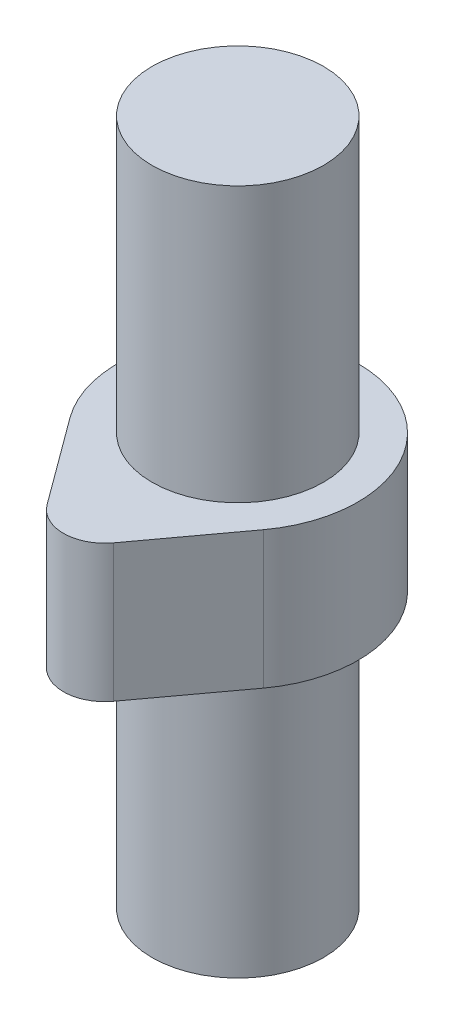
ISO-10303-21;
HEADER;
FILE_DESCRIPTION(('STEP AP214'),'2;1');
FILE_NAME('part.step','',(''),(''),'','','');
FILE_SCHEMA(('AUTOMOTIVE_DESIGN { 1 0 10303 214 1 1 1 1 }'));
ENDSEC;
DATA;
#1=APPLICATION_CONTEXT('core data for automotive mechanical design processes');
#2=APPLICATION_PROTOCOL_DEFINITION('international standard','automotive_design',2000,#1);
#3=PRODUCT_CONTEXT('',#1,'mechanical');
#4=PRODUCT('Part','Part','',(#3));
#5=PRODUCT_RELATED_PRODUCT_CATEGORY('part','',(#4));
#6=PRODUCT_DEFINITION_FORMATION('','',#4);
#7=PRODUCT_DEFINITION_CONTEXT('part definition',#1,'design');
#8=PRODUCT_DEFINITION('design','',#6,#7);
#9=PRODUCT_DEFINITION_SHAPE('','',#8);
#10=(LENGTH_UNIT() NAMED_UNIT(*) SI_UNIT(.MILLI.,.METRE.));
#11=(NAMED_UNIT(*) PLANE_ANGLE_UNIT() SI_UNIT($,.RADIAN.));
#12=(NAMED_UNIT(*) SI_UNIT($,.STERADIAN.) SOLID_ANGLE_UNIT());
#13=UNCERTAINTY_MEASURE_WITH_UNIT(LENGTH_MEASURE(1.E-05),#10,'distance_accuracy_value','');
#14=(GEOMETRIC_REPRESENTATION_CONTEXT(3) GLOBAL_UNCERTAINTY_ASSIGNED_CONTEXT((#13)) GLOBAL_UNIT_ASSIGNED_CONTEXT((#10,
#11,#12)) REPRESENTATION_CONTEXT('',''));
#15=CARTESIAN_POINT('',(0.,0.,0.));
#16=DIRECTION('',(0.,0.,1.));
#17=DIRECTION('',(1.,0.,0.));
#18=AXIS2_PLACEMENT_3D('',#15,#16,#17);
#19=CARTESIAN_POINT('',(-33.587339903571,99.6470504536906,3.70444137397527));
#20=DIRECTION('',(0.,-1.,0.));
#21=DIRECTION('',(0.,0.,-1.));
#22=AXIS2_PLACEMENT_3D('',#19,#20,#21);
#23=PLANE('',#22);
#24=CARTESIAN_POINT('',(-39.837339903571,99.6470504536906,3.70444137397565));
#25=DIRECTION('',(0.,-1.,0.));
#26=DIRECTION('',(0.,0.,-1.));
#27=AXIS2_PLACEMENT_3D('',#24,#25,#26);
#28=CIRCLE('',#27,6.25);
#29=CARTESIAN_POINT('',(-39.837339903571,99.6470504536906,-2.54555862602435));
#30=VERTEX_POINT('',#29);
#31=EDGE_CURVE('E21',#30,#30,#28,.T.);
#32=ORIENTED_EDGE('',*,*,#31,.F.);
#33=EDGE_LOOP('',(#32));
#34=FACE_BOUND('',#33,.T.);
#35=ADVANCED_FACE('F17',(#34),#23,.F.);
#36=CARTESIAN_POINT('',(-39.837339903571,99.6470504536906,3.70444137397565));
#37=DIRECTION('',(0.,-1.,0.));
#38=DIRECTION('',(0.,0.,-1.));
#39=AXIS2_PLACEMENT_3D('',#36,#37,#38);
#40=CYLINDRICAL_SURFACE('',#39,6.25);
#41=ORIENTED_EDGE('',*,*,#31,.T.);
#42=EDGE_LOOP('',(#41));
#43=FACE_BOUND('',#42,.T.);
#44=CARTESIAN_POINT('',(-39.837339903571,79.6470504536906,3.70444137397565));
#45=DIRECTION('',(0.,-1.,0.));
#46=DIRECTION('',(0.,0.,-1.));
#47=AXIS2_PLACEMENT_3D('',#44,#45,#46);
#48=CIRCLE('',#47,6.25);
#49=CARTESIAN_POINT('',(-39.837339903571,79.6470504536906,-2.54555862602435));
#50=VERTEX_POINT('',#49);
#51=EDGE_CURVE('E75',#50,#50,#48,.F.);
#52=ORIENTED_EDGE('',*,*,#51,.T.);
#53=EDGE_LOOP('',(#52));
#54=FACE_BOUND('',#53,.T.);
#55=ADVANCED_FACE('F100',(#43,#54),#40,.T.);
#56=CARTESIAN_POINT('',(-46.8842561268218,79.6470504536906,8.89129704407918));
#57=DIRECTION('',(0.,-1.,0.));
#58=DIRECTION('',(0.,0.,-1.));
#59=AXIS2_PLACEMENT_3D('',#56,#57,#58);
#60=PLANE('',#59);
#61=ORIENTED_EDGE('',*,*,#51,.F.);
#62=EDGE_LOOP('',(#61));
#63=FACE_BOUND('',#62,.T.);
#64=DIRECTION('',(0.592783505154689,0.,0.805361854085802));
#65=VECTOR('',#64,1.);
#66=CARTESIAN_POINT('',(-42.2534254658279,79.6470504536906,15.1827918894397));
#67=LINE('',#66,#65);
#68=CARTESIAN_POINT('',(-42.2534254658279,79.6470504536906,15.1827918894397));
#69=VERTEX_POINT('',#68);
#70=CARTESIAN_POINT('',(-46.8842561268218,79.6470504536906,8.89129704407918));
#71=VERTEX_POINT('',#70);
#72=EDGE_CURVE('E66',#69,#71,#67,.F.);
#73=ORIENTED_EDGE('',*,*,#72,.F.);
#74=CARTESIAN_POINT('',(-39.8373399035705,79.6470504536906,13.4044413739756));
#75=DIRECTION('',(0.,1.,0.));
#76=DIRECTION('',(0.,0.,1.));
#77=AXIS2_PLACEMENT_3D('',#74,#75,#76);
#78=CIRCLE('',#77,3.);
#79=CARTESIAN_POINT('',(-37.4212543413128,79.6470504536906,15.1827918894394));
#80=VERTEX_POINT('',#79);
#81=EDGE_CURVE('E72',#80,#69,#78,.F.);
#82=ORIENTED_EDGE('',*,*,#81,.F.);
#83=DIRECTION('',(0.592783505154591,0.,-0.805361854085874));
#84=VECTOR('',#83,1.);
#85=CARTESIAN_POINT('',(-32.7904236803196,79.6470504536906,8.89129704407832));
#86=LINE('',#85,#84);
#87=CARTESIAN_POINT('',(-32.7904236803196,79.6470504536906,8.89129704407831));
#88=VERTEX_POINT('',#87);
#89=EDGE_CURVE('E69',#88,#80,#86,.F.);
#90=ORIENTED_EDGE('',*,*,#89,.F.);
#91=CARTESIAN_POINT('',(-39.8373399035711,79.6470504536906,3.70444137397564));
#92=DIRECTION('',(0.,1.,0.));
#93=DIRECTION('',(0.,0.,1.));
#94=AXIS2_PLACEMENT_3D('',#91,#92,#93);
#95=CIRCLE('',#94,8.75);
#96=EDGE_CURVE('E57',#71,#88,#95,.F.);
#97=ORIENTED_EDGE('',*,*,#96,.F.);
#98=EDGE_LOOP('',(#73,#82,#90,#97));
#99=FACE_BOUND('',#98,.T.);
#100=ADVANCED_FACE('F70',(#63,#99),#60,.F.);
#101=CARTESIAN_POINT('',(-32.7904236803196,74.6470504536907,8.89129704407832));
#102=DIRECTION('',(0.805361854085874,0.,0.592783505154591));
#103=DIRECTION('',(0.592783505154591,0.,-0.805361854085874));
#104=AXIS2_PLACEMENT_3D('',#101,#102,#103);
#105=PLANE('',#104);
#106=DIRECTION('',(0.59278350515459,0.,-0.805361854085875));
#107=VECTOR('',#106,1.);
#108=CARTESIAN_POINT('',(-37.4212543413128,69.6470504536906,15.1827918894394));
#109=LINE('',#108,#107);
#110=CARTESIAN_POINT('',(-37.4212543413128,69.6470504536906,15.1827918894394));
#111=VERTEX_POINT('',#110);
#112=CARTESIAN_POINT('',(-32.7904236803196,69.6470504536906,8.89129704407831));
#113=VERTEX_POINT('',#112);
#114=EDGE_CURVE('E80',#111,#113,#109,.T.);
#115=ORIENTED_EDGE('',*,*,#114,.T.);
#116=DIRECTION('',(0.,1.,0.));
#117=VECTOR('',#116,1.);
#118=CARTESIAN_POINT('',(-32.7904236803197,74.6470504536907,8.89129704407831));
#119=LINE('',#118,#117);
#120=EDGE_CURVE('E63',#88,#113,#119,.F.);
#121=ORIENTED_EDGE('',*,*,#120,.F.);
#122=ORIENTED_EDGE('',*,*,#89,.T.);
#123=DIRECTION('',(0.,1.,0.));
#124=VECTOR('',#123,1.);
#125=CARTESIAN_POINT('',(-37.4212543413128,74.6470504536907,15.1827918894394));
#126=LINE('',#125,#124);
#127=EDGE_CURVE('E129',#111,#80,#126,.T.);
#128=ORIENTED_EDGE('',*,*,#127,.F.);
#129=EDGE_LOOP('',(#115,#121,#122,#128));
#130=FACE_BOUND('',#129,.T.);
#131=ADVANCED_FACE('F78',(#130),#105,.T.);
#132=CARTESIAN_POINT('',(-39.8373399035711,69.6470504536906,3.70444137397564));
#133=DIRECTION('',(0.,1.,0.));
#134=DIRECTION('',(0.,0.,1.));
#135=AXIS2_PLACEMENT_3D('',#132,#133,#134);
#136=CYLINDRICAL_SURFACE('',#135,8.75);
#137=DIRECTION('',(0.,1.,0.));
#138=VECTOR('',#137,1.);
#139=CARTESIAN_POINT('',(-46.8842561268218,74.6470504536907,8.89129704407918));
#140=LINE('',#139,#138);
#141=CARTESIAN_POINT('',(-46.8842561268218,69.6470504536906,8.89129704407918));
#142=VERTEX_POINT('',#141);
#143=EDGE_CURVE('E64',#71,#142,#140,.F.);
#144=ORIENTED_EDGE('',*,*,#143,.F.);
#145=ORIENTED_EDGE('',*,*,#96,.T.);
#146=ORIENTED_EDGE('',*,*,#120,.T.);
#147=CARTESIAN_POINT('',(-39.8373399035711,69.6470504536906,3.70444137397564));
#148=DIRECTION('',(0.,1.,0.));
#149=DIRECTION('',(0.,0.,1.));
#150=AXIS2_PLACEMENT_3D('',#147,#148,#149);
#151=CIRCLE('',#150,8.75);
#152=EDGE_CURVE('E91',#113,#142,#151,.T.);
#153=ORIENTED_EDGE('',*,*,#152,.T.);
#154=EDGE_LOOP('',(#144,#145,#146,#153));
#155=FACE_BOUND('',#154,.T.);
#156=ADVANCED_FACE('F61',(#155),#136,.T.);
#157=CARTESIAN_POINT('',(-42.2534254658279,74.6470504536907,15.1827918894397));
#158=DIRECTION('',(-0.805361854085802,0.,0.592783505154689));
#159=DIRECTION('',(0.592783505154689,0.,0.805361854085802));
#160=AXIS2_PLACEMENT_3D('',#157,#158,#159);
#161=PLANE('',#160);
#162=DIRECTION('',(0.592783505154689,0.,0.805361854085802));
#163=VECTOR('',#162,1.);
#164=CARTESIAN_POINT('',(-46.8842561268218,69.6470504536906,8.89129704407918));
#165=LINE('',#164,#163);
#166=CARTESIAN_POINT('',(-42.2534254658279,69.6470504536906,15.1827918894397));
#167=VERTEX_POINT('',#166);
#168=EDGE_CURVE('E36',#142,#167,#165,.T.);
#169=ORIENTED_EDGE('',*,*,#168,.T.);
#170=DIRECTION('',(0.,1.,0.));
#171=VECTOR('',#170,1.);
#172=CARTESIAN_POINT('',(-42.2534254658279,74.6470504536907,15.1827918894397));
#173=LINE('',#172,#171);
#174=EDGE_CURVE('E93',#69,#167,#173,.F.);
#175=ORIENTED_EDGE('',*,*,#174,.F.);
#176=ORIENTED_EDGE('',*,*,#72,.T.);
#177=ORIENTED_EDGE('',*,*,#143,.T.);
#178=EDGE_LOOP('',(#169,#175,#176,#177));
#179=FACE_BOUND('',#178,.T.);
#180=ADVANCED_FACE('F131',(#179),#161,.T.);
#181=CARTESIAN_POINT('',(-39.8373399035705,69.6470504536906,13.4044413739756));
#182=DIRECTION('',(0.,1.,0.));
#183=DIRECTION('',(0.,0.,1.));
#184=AXIS2_PLACEMENT_3D('',#181,#182,#183);
#185=CYLINDRICAL_SURFACE('',#184,3.);
#186=CARTESIAN_POINT('',(-39.8373399035705,69.6470504536906,13.4044413739756));
#187=DIRECTION('',(0.,1.,0.));
#188=DIRECTION('',(0.,0.,1.));
#189=AXIS2_PLACEMENT_3D('',#186,#187,#188);
#190=CIRCLE('',#189,3.);
#191=EDGE_CURVE('E88',#167,#111,#190,.T.);
#192=ORIENTED_EDGE('',*,*,#191,.T.);
#193=ORIENTED_EDGE('',*,*,#127,.T.);
#194=ORIENTED_EDGE('',*,*,#81,.T.);
#195=ORIENTED_EDGE('',*,*,#174,.T.);
#196=EDGE_LOOP('',(#192,#193,#194,#195));
#197=FACE_BOUND('',#196,.T.);
#198=ADVANCED_FACE('F123',(#197),#185,.T.);
#199=CARTESIAN_POINT('',(-42.2534254658279,69.6470504536906,15.1827918894397));
#200=DIRECTION('',(0.,1.,0.));
#201=DIRECTION('',(0.,0.,1.));
#202=AXIS2_PLACEMENT_3D('',#199,#200,#201);
#203=PLANE('',#202);
#204=CARTESIAN_POINT('',(-39.837339903571,69.6470504536906,3.70444137397564));
#205=DIRECTION('',(0.,-1.,0.));
#206=DIRECTION('',(0.,0.,-1.));
#207=AXIS2_PLACEMENT_3D('',#204,#205,#206);
#208=CIRCLE('',#207,6.25);
#209=CARTESIAN_POINT('',(-39.837339903571,69.6470504536906,-2.54555862602435));
#210=VERTEX_POINT('',#209);
#211=EDGE_CURVE('E27',#210,#210,#208,.T.);
#212=ORIENTED_EDGE('',*,*,#211,.F.);
#213=EDGE_LOOP('',(#212));
#214=FACE_BOUND('',#213,.T.);
#215=ORIENTED_EDGE('',*,*,#168,.F.);
#216=ORIENTED_EDGE('',*,*,#152,.F.);
#217=ORIENTED_EDGE('',*,*,#114,.F.);
#218=ORIENTED_EDGE('',*,*,#191,.F.);
#219=EDGE_LOOP('',(#215,#216,#217,#218));
#220=FACE_BOUND('',#219,.T.);
#221=ADVANCED_FACE('F115',(#214,#220),#203,.F.);
#222=CARTESIAN_POINT('',(-33.587339903571,49.6470504536906,3.70444137397526));
#223=DIRECTION('',(0.,-1.,0.));
#224=DIRECTION('',(0.,0.,-1.));
#225=AXIS2_PLACEMENT_3D('',#222,#223,#224);
#226=PLANE('',#225);
#227=CARTESIAN_POINT('',(-39.837339903571,49.6470504536906,3.70444137397564));
#228=DIRECTION('',(0.,-1.,0.));
#229=DIRECTION('',(0.,0.,-1.));
#230=AXIS2_PLACEMENT_3D('',#227,#228,#229);
#231=CIRCLE('',#230,6.25);
#232=CARTESIAN_POINT('',(-39.837339903571,49.6470504536906,-2.54555862602436));
#233=VERTEX_POINT('',#232);
#234=EDGE_CURVE('E11',#233,#233,#231,.F.);
#235=ORIENTED_EDGE('',*,*,#234,.F.);
#236=EDGE_LOOP('',(#235));
#237=FACE_BOUND('',#236,.T.);
#238=ADVANCED_FACE('F110',(#237),#226,.T.);
#239=CARTESIAN_POINT('',(-39.837339903571,69.6470504536906,3.70444137397564));
#240=DIRECTION('',(0.,-1.,0.));
#241=DIRECTION('',(0.,0.,-1.));
#242=AXIS2_PLACEMENT_3D('',#239,#240,#241);
#243=CYLINDRICAL_SURFACE('',#242,6.25);
#244=ORIENTED_EDGE('',*,*,#211,.T.);
#245=EDGE_LOOP('',(#244));
#246=FACE_BOUND('',#245,.T.);
#247=ORIENTED_EDGE('',*,*,#234,.T.);
#248=EDGE_LOOP('',(#247));
#249=FACE_BOUND('',#248,.T.);
#250=ADVANCED_FACE('F19',(#246,#249),#243,.T.);
#251=CLOSED_SHELL('',(#35,#55,#100,#131,#156,#180,#198,#221,#238,#250));
#252=MANIFOLD_SOLID_BREP('B1',#251);
#253=ADVANCED_BREP_SHAPE_REPRESENTATION('',(#18,#252),#14);
#254=SHAPE_DEFINITION_REPRESENTATION(#9,#253);
ENDSEC;
END-ISO-10303-21;
